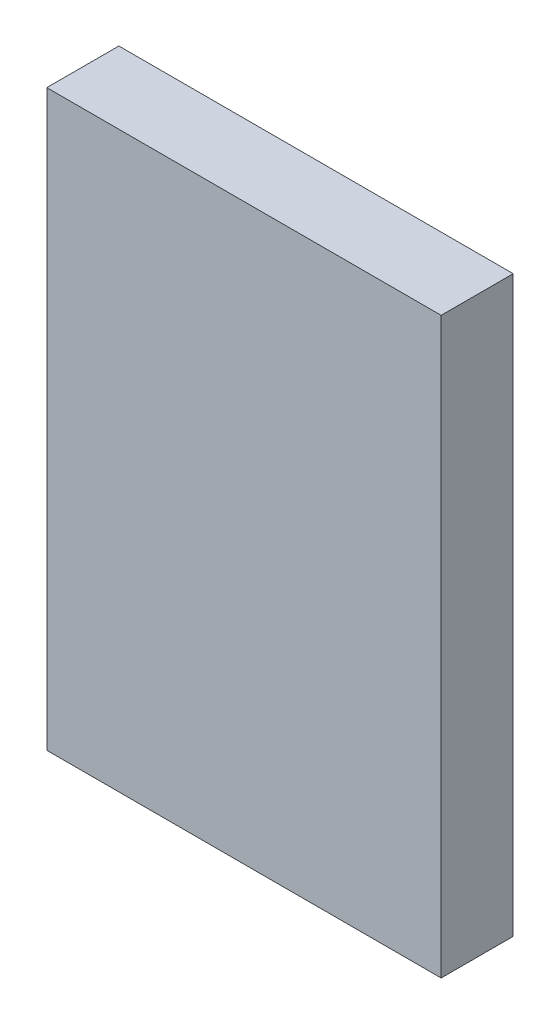
ISO-10303-21;
HEADER;
FILE_DESCRIPTION(('STEP AP214'),'2;1');
FILE_NAME('part.step','',(''),(''),'','','');
FILE_SCHEMA(('AUTOMOTIVE_DESIGN { 1 0 10303 214 1 1 1 1 }'));
ENDSEC;
DATA;
#1=APPLICATION_CONTEXT('core data for automotive mechanical design processes');
#2=APPLICATION_PROTOCOL_DEFINITION('international standard','automotive_design',2000,#1);
#3=PRODUCT_CONTEXT('',#1,'mechanical');
#4=PRODUCT('Part','Part','',(#3));
#5=PRODUCT_RELATED_PRODUCT_CATEGORY('part','',(#4));
#6=PRODUCT_DEFINITION_FORMATION('','',#4);
#7=PRODUCT_DEFINITION_CONTEXT('part definition',#1,'design');
#8=PRODUCT_DEFINITION('design','',#6,#7);
#9=PRODUCT_DEFINITION_SHAPE('','',#8);
#10=(LENGTH_UNIT() NAMED_UNIT(*) SI_UNIT(.MILLI.,.METRE.));
#11=(NAMED_UNIT(*) PLANE_ANGLE_UNIT() SI_UNIT($,.RADIAN.));
#12=(NAMED_UNIT(*) SI_UNIT($,.STERADIAN.) SOLID_ANGLE_UNIT());
#13=UNCERTAINTY_MEASURE_WITH_UNIT(LENGTH_MEASURE(1.E-05),#10,'distance_accuracy_value','');
#14=(GEOMETRIC_REPRESENTATION_CONTEXT(3) GLOBAL_UNCERTAINTY_ASSIGNED_CONTEXT((#13)) GLOBAL_UNIT_ASSIGNED_CONTEXT((#10,
#11,#12)) REPRESENTATION_CONTEXT('',''));
#15=CARTESIAN_POINT('',(0.,0.,0.));
#16=DIRECTION('',(0.,0.,1.));
#17=DIRECTION('',(1.,0.,0.));
#18=AXIS2_PLACEMENT_3D('',#15,#16,#17);
#19=CARTESIAN_POINT('',(0.318,1.143,0.));
#20=DIRECTION('',(0.,-1.,0.));
#21=DIRECTION('',(0.,0.,-1.));
#22=AXIS2_PLACEMENT_3D('',#19,#20,#21);
#23=PLANE('',#22);
#24=DIRECTION('',(-1.,0.,0.));
#25=VECTOR('',#24,1.);
#26=CARTESIAN_POINT('',(0.597,1.143,0.));
#27=LINE('',#26,#25);
#28=CARTESIAN_POINT('',(0.597,1.143,0.));
#29=VERTEX_POINT('',#28);
#30=CARTESIAN_POINT('',(0.318,1.143,0.));
#31=VERTEX_POINT('',#30);
#32=EDGE_CURVE('E11',#29,#31,#27,.T.);
#33=ORIENTED_EDGE('',*,*,#32,.F.);
#34=DIRECTION('',(0.,0.,-1.));
#35=VECTOR('',#34,1.);
#36=CARTESIAN_POINT('',(0.597,1.143,0.051));
#37=LINE('',#36,#35);
#38=CARTESIAN_POINT('',(0.597,1.143,0.051));
#39=VERTEX_POINT('',#38);
#40=EDGE_CURVE('E24',#39,#29,#37,.T.);
#41=ORIENTED_EDGE('',*,*,#40,.F.);
#42=DIRECTION('',(1.,0.,0.));
#43=VECTOR('',#42,1.);
#44=CARTESIAN_POINT('',(0.318,1.143,0.051));
#45=LINE('',#44,#43);
#46=CARTESIAN_POINT('',(0.318,1.143,0.051));
#47=VERTEX_POINT('',#46);
#48=EDGE_CURVE('E88',#47,#39,#45,.T.);
#49=ORIENTED_EDGE('',*,*,#48,.F.);
#50=DIRECTION('',(0.,0.,1.));
#51=VECTOR('',#50,1.);
#52=CARTESIAN_POINT('',(0.318,1.143,0.));
#53=LINE('',#52,#51);
#54=EDGE_CURVE('E77',#31,#47,#53,.T.);
#55=ORIENTED_EDGE('',*,*,#54,.F.);
#56=EDGE_LOOP('',(#33,#41,#49,#55));
#57=FACE_BOUND('',#56,.T.);
#58=ADVANCED_FACE('F17',(#57),#23,.T.);
#59=CARTESIAN_POINT('',(0.597,1.143,0.));
#60=DIRECTION('',(1.,0.,0.));
#61=DIRECTION('',(0.,1.,0.));
#62=AXIS2_PLACEMENT_3D('',#59,#60,#61);
#63=PLANE('',#62);
#64=DIRECTION('',(0.,-1.,0.));
#65=VECTOR('',#64,1.);
#66=CARTESIAN_POINT('',(0.597,1.549,0.));
#67=LINE('',#66,#65);
#68=CARTESIAN_POINT('',(0.597,1.549,0.));
#69=VERTEX_POINT('',#68);
#70=EDGE_CURVE('E85',#69,#29,#67,.T.);
#71=ORIENTED_EDGE('',*,*,#70,.F.);
#72=DIRECTION('',(0.,0.,-1.));
#73=VECTOR('',#72,1.);
#74=CARTESIAN_POINT('',(0.597,1.549,0.051));
#75=LINE('',#74,#73);
#76=CARTESIAN_POINT('',(0.597,1.549,0.051));
#77=VERTEX_POINT('',#76);
#78=EDGE_CURVE('E83',#77,#69,#75,.T.);
#79=ORIENTED_EDGE('',*,*,#78,.F.);
#80=DIRECTION('',(0.,1.,0.));
#81=VECTOR('',#80,1.);
#82=CARTESIAN_POINT('',(0.597,1.143,0.051));
#83=LINE('',#82,#81);
#84=EDGE_CURVE('E72',#39,#77,#83,.T.);
#85=ORIENTED_EDGE('',*,*,#84,.F.);
#86=ORIENTED_EDGE('',*,*,#40,.T.);
#87=EDGE_LOOP('',(#71,#79,#85,#86));
#88=FACE_BOUND('',#87,.T.);
#89=ADVANCED_FACE('F90',(#88),#63,.T.);
#90=CARTESIAN_POINT('',(0.597,1.549,0.));
#91=DIRECTION('',(0.,1.,0.));
#92=DIRECTION('',(1.,0.,0.));
#93=AXIS2_PLACEMENT_3D('',#90,#91,#92);
#94=PLANE('',#93);
#95=DIRECTION('',(1.,0.,0.));
#96=VECTOR('',#95,1.);
#97=CARTESIAN_POINT('',(0.318,1.549,0.));
#98=LINE('',#97,#96);
#99=CARTESIAN_POINT('',(0.318,1.549,0.));
#100=VERTEX_POINT('',#99);
#101=EDGE_CURVE('E60',#100,#69,#98,.T.);
#102=ORIENTED_EDGE('',*,*,#101,.F.);
#103=DIRECTION('',(0.,0.,-1.));
#104=VECTOR('',#103,1.);
#105=CARTESIAN_POINT('',(0.318,1.549,0.051));
#106=LINE('',#105,#104);
#107=CARTESIAN_POINT('',(0.318,1.549,0.051));
#108=VERTEX_POINT('',#107);
#109=EDGE_CURVE('E54',#108,#100,#106,.T.);
#110=ORIENTED_EDGE('',*,*,#109,.F.);
#111=DIRECTION('',(-1.,0.,0.));
#112=VECTOR('',#111,1.);
#113=CARTESIAN_POINT('',(0.597,1.549,0.051));
#114=LINE('',#113,#112);
#115=EDGE_CURVE('E58',#77,#108,#114,.T.);
#116=ORIENTED_EDGE('',*,*,#115,.F.);
#117=ORIENTED_EDGE('',*,*,#78,.T.);
#118=EDGE_LOOP('',(#102,#110,#116,#117));
#119=FACE_BOUND('',#118,.T.);
#120=ADVANCED_FACE('F56',(#119),#94,.T.);
#121=CARTESIAN_POINT('',(0.318,1.549,0.));
#122=DIRECTION('',(-1.,0.,0.));
#123=DIRECTION('',(0.,0.,1.));
#124=AXIS2_PLACEMENT_3D('',#121,#122,#123);
#125=PLANE('',#124);
#126=DIRECTION('',(0.,1.,0.));
#127=VECTOR('',#126,1.);
#128=CARTESIAN_POINT('',(0.318,1.143,0.));
#129=LINE('',#128,#127);
#130=EDGE_CURVE('E73',#31,#100,#129,.T.);
#131=ORIENTED_EDGE('',*,*,#130,.F.);
#132=ORIENTED_EDGE('',*,*,#54,.T.);
#133=DIRECTION('',(0.,-1.,0.));
#134=VECTOR('',#133,1.);
#135=CARTESIAN_POINT('',(0.318,1.549,0.051));
#136=LINE('',#135,#134);
#137=EDGE_CURVE('E70',#108,#47,#136,.T.);
#138=ORIENTED_EDGE('',*,*,#137,.F.);
#139=ORIENTED_EDGE('',*,*,#109,.T.);
#140=EDGE_LOOP('',(#131,#132,#138,#139));
#141=FACE_BOUND('',#140,.T.);
#142=ADVANCED_FACE('F76',(#141),#125,.T.);
#143=CARTESIAN_POINT('',(0.318,1.549,0.));
#144=DIRECTION('',(0.,0.,-1.));
#145=DIRECTION('',(0.,-1.,0.));
#146=AXIS2_PLACEMENT_3D('',#143,#144,#145);
#147=PLANE('',#146);
#148=ORIENTED_EDGE('',*,*,#101,.T.);
#149=ORIENTED_EDGE('',*,*,#70,.T.);
#150=ORIENTED_EDGE('',*,*,#32,.T.);
#151=ORIENTED_EDGE('',*,*,#130,.T.);
#152=EDGE_LOOP('',(#148,#149,#150,#151));
#153=FACE_BOUND('',#152,.T.);
#154=ADVANCED_FACE('F91',(#153),#147,.T.);
#155=CARTESIAN_POINT('',(0.318,1.143,0.051));
#156=DIRECTION('',(0.,0.,1.));
#157=DIRECTION('',(1.,0.,0.));
#158=AXIS2_PLACEMENT_3D('',#155,#156,#157);
#159=PLANE('',#158);
#160=ORIENTED_EDGE('',*,*,#48,.T.);
#161=ORIENTED_EDGE('',*,*,#84,.T.);
#162=ORIENTED_EDGE('',*,*,#115,.T.);
#163=ORIENTED_EDGE('',*,*,#137,.T.);
#164=EDGE_LOOP('',(#160,#161,#162,#163));
#165=FACE_BOUND('',#164,.T.);
#166=ADVANCED_FACE('F69',(#165),#159,.T.);
#167=CLOSED_SHELL('',(#58,#89,#120,#142,#154,#166));
#168=MANIFOLD_SOLID_BREP('B1',#167);
#169=ADVANCED_BREP_SHAPE_REPRESENTATION('',(#18,#168),#14);
#170=SHAPE_DEFINITION_REPRESENTATION(#9,#169);
ENDSEC;
END-ISO-10303-21;
